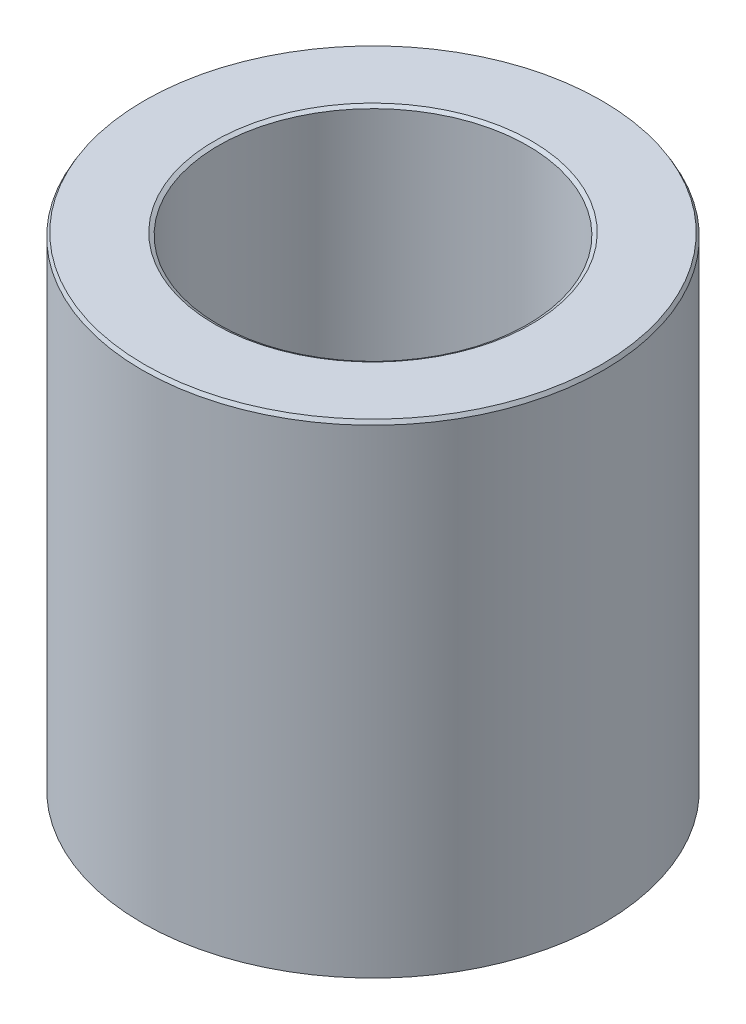
ISO-10303-21;
HEADER;
FILE_DESCRIPTION(('STEP AP214'),'2;1');
FILE_NAME('part.step','',(''),(''),'','','');
FILE_SCHEMA(('AUTOMOTIVE_DESIGN { 1 0 10303 214 1 1 1 1 }'));
ENDSEC;
DATA;
#1=APPLICATION_CONTEXT('core data for automotive mechanical design processes');
#2=APPLICATION_PROTOCOL_DEFINITION('international standard','automotive_design',2000,#1);
#3=PRODUCT_CONTEXT('',#1,'mechanical');
#4=PRODUCT('Part','Part','',(#3));
#5=PRODUCT_RELATED_PRODUCT_CATEGORY('part','',(#4));
#6=PRODUCT_DEFINITION_FORMATION('','',#4);
#7=PRODUCT_DEFINITION_CONTEXT('part definition',#1,'design');
#8=PRODUCT_DEFINITION('design','',#6,#7);
#9=PRODUCT_DEFINITION_SHAPE('','',#8);
#10=(LENGTH_UNIT() NAMED_UNIT(*) SI_UNIT(.MILLI.,.METRE.));
#11=(NAMED_UNIT(*) PLANE_ANGLE_UNIT() SI_UNIT($,.RADIAN.));
#12=(NAMED_UNIT(*) SI_UNIT($,.STERADIAN.) SOLID_ANGLE_UNIT());
#13=UNCERTAINTY_MEASURE_WITH_UNIT(LENGTH_MEASURE(1.E-05),#10,'distance_accuracy_value','');
#14=(GEOMETRIC_REPRESENTATION_CONTEXT(3) GLOBAL_UNCERTAINTY_ASSIGNED_CONTEXT((#13)) GLOBAL_UNIT_ASSIGNED_CONTEXT((#10,
#11,#12)) REPRESENTATION_CONTEXT('',''));
#15=CARTESIAN_POINT('',(0.,0.,0.));
#16=DIRECTION('',(0.,0.,1.));
#17=DIRECTION('',(1.,0.,0.));
#18=AXIS2_PLACEMENT_3D('',#15,#16,#17);
#19=CARTESIAN_POINT('',(0.,57.7614955437771,0.));
#20=DIRECTION('',(0.,-1.,0.));
#21=DIRECTION('',(0.,0.,-1.));
#22=AXIS2_PLACEMENT_3D('',#19,#20,#21);
#23=CYLINDRICAL_SURFACE('',#22,27.5);
#24=CARTESIAN_POINT('',(0.,0.259318501616798,0.));
#25=DIRECTION('',(0.,1.,0.));
#26=DIRECTION('',(0.,0.,1.));
#27=AXIS2_PLACEMENT_3D('',#24,#25,#26);
#28=CIRCLE('',#27,27.5);
#29=CARTESIAN_POINT('',(0.,0.259318501616798,27.5));
#30=VERTEX_POINT('',#29);
#31=EDGE_CURVE('E10',#30,#30,#28,.T.);
#32=ORIENTED_EDGE('',*,*,#31,.T.);
#33=EDGE_LOOP('',(#32));
#34=FACE_BOUND('',#33,.T.);
#35=CARTESIAN_POINT('',(0.,57.3123427236342,0.));
#36=DIRECTION('',(0.,1.,0.));
#37=DIRECTION('',(0.,0.,1.));
#38=AXIS2_PLACEMENT_3D('',#35,#36,#37);
#39=CIRCLE('',#38,27.5);
#40=CARTESIAN_POINT('',(0.,57.3123427236342,27.5));
#41=VERTEX_POINT('',#40);
#42=EDGE_CURVE('E50',#41,#41,#39,.F.);
#43=ORIENTED_EDGE('',*,*,#42,.T.);
#44=EDGE_LOOP('',(#43));
#45=FACE_BOUND('',#44,.T.);
#46=ADVANCED_FACE('F39',(#34,#45),#23,.T.);
#47=CARTESIAN_POINT('',(0.,57.7614955437771,0.));
#48=DIRECTION('',(0.,1.,0.));
#49=DIRECTION('',(0.,0.,1.));
#50=AXIS2_PLACEMENT_3D('',#47,#48,#49);
#51=PLANE('',#50);
#52=CARTESIAN_POINT('',(0.,57.7614955437771,0.));
#53=DIRECTION('',(0.,1.,0.));
#54=DIRECTION('',(0.,0.,1.));
#55=AXIS2_PLACEMENT_3D('',#52,#53,#54);
#56=CIRCLE('',#55,18.8958268331915);
#57=CARTESIAN_POINT('',(0.,57.7614955437771,18.8958268331915));
#58=VERTEX_POINT('',#57);
#59=EDGE_CURVE('E58',#58,#58,#56,.F.);
#60=ORIENTED_EDGE('',*,*,#59,.T.);
#61=EDGE_LOOP('',(#60));
#62=FACE_BOUND('',#61,.T.);
#63=CARTESIAN_POINT('',(0.,57.7614955437771,0.));
#64=DIRECTION('',(0.,1.,0.));
#65=DIRECTION('',(0.,0.,1.));
#66=AXIS2_PLACEMENT_3D('',#63,#64,#65);
#67=CIRCLE('',#66,27.2406814983832);
#68=CARTESIAN_POINT('',(0.,57.7614955437771,27.2406814983832));
#69=VERTEX_POINT('',#68);
#70=EDGE_CURVE('E61',#69,#69,#67,.T.);
#71=ORIENTED_EDGE('',*,*,#70,.T.);
#72=EDGE_LOOP('',(#71));
#73=FACE_BOUND('',#72,.T.);
#74=ADVANCED_FACE('F88',(#62,#73),#51,.T.);
#75=CARTESIAN_POINT('',(0.,0.,0.));
#76=DIRECTION('',(0.,1.,0.));
#77=DIRECTION('',(0.,0.,1.));
#78=AXIS2_PLACEMENT_3D('',#75,#76,#77);
#79=PLANE('',#78);
#80=CARTESIAN_POINT('',(0.,0.,0.));
#81=DIRECTION('',(0.,1.,0.));
#82=DIRECTION('',(0.,0.,1.));
#83=AXIS2_PLACEMENT_3D('',#80,#81,#82);
#84=CIRCLE('',#83,18.7059925146654);
#85=CARTESIAN_POINT('',(0.,0.,18.7059925146654));
#86=VERTEX_POINT('',#85);
#87=EDGE_CURVE('E51',#86,#86,#84,.T.);
#88=ORIENTED_EDGE('',*,*,#87,.T.);
#89=EDGE_LOOP('',(#88));
#90=FACE_BOUND('',#89,.T.);
#91=CARTESIAN_POINT('',(0.,0.,0.));
#92=DIRECTION('',(0.,1.,0.));
#93=DIRECTION('',(0.,0.,1.));
#94=AXIS2_PLACEMENT_3D('',#91,#92,#93);
#95=CIRCLE('',#94,27.0508471798571);
#96=CARTESIAN_POINT('',(0.,0.,27.0508471798571));
#97=VERTEX_POINT('',#96);
#98=EDGE_CURVE('E54',#97,#97,#95,.F.);
#99=ORIENTED_EDGE('',*,*,#98,.T.);
#100=EDGE_LOOP('',(#99));
#101=FACE_BOUND('',#100,.T.);
#102=ADVANCED_FACE('F83',(#90,#101),#79,.F.);
#103=CARTESIAN_POINT('',(0.,57.7614955437771,0.));
#104=DIRECTION('',(0.,-1.,0.));
#105=DIRECTION('',(0.,0.,-1.));
#106=AXIS2_PLACEMENT_3D('',#103,#104,#105);
#107=CYLINDRICAL_SURFACE('',#106,18.4466740130486);
#108=CARTESIAN_POINT('',(0.,57.5021770421603,0.));
#109=DIRECTION('',(0.,1.,0.));
#110=DIRECTION('',(0.,0.,1.));
#111=AXIS2_PLACEMENT_3D('',#108,#109,#110);
#112=CIRCLE('',#111,18.4466740130486);
#113=CARTESIAN_POINT('',(0.,57.5021770421603,18.4466740130486));
#114=VERTEX_POINT('',#113);
#115=EDGE_CURVE('E67',#114,#114,#112,.T.);
#116=ORIENTED_EDGE('',*,*,#115,.T.);
#117=EDGE_LOOP('',(#116));
#118=FACE_BOUND('',#117,.T.);
#119=CARTESIAN_POINT('',(0.,0.449152820142927,0.));
#120=DIRECTION('',(0.,1.,0.));
#121=DIRECTION('',(0.,0.,1.));
#122=AXIS2_PLACEMENT_3D('',#119,#120,#121);
#123=CIRCLE('',#122,18.4466740130486);
#124=CARTESIAN_POINT('',(0.,0.449152820142927,18.4466740130486));
#125=VERTEX_POINT('',#124);
#126=EDGE_CURVE('E69',#125,#125,#123,.F.);
#127=ORIENTED_EDGE('',*,*,#126,.T.);
#128=EDGE_LOOP('',(#127));
#129=FACE_BOUND('',#128,.T.);
#130=ADVANCED_FACE('F71',(#118,#129),#107,.F.);
#131=CARTESIAN_POINT('',(0.,57.5021770421603,0.));
#132=DIRECTION('',(0.,1.,0.));
#133=DIRECTION('',(0.,0.,1.));
#134=AXIS2_PLACEMENT_3D('',#131,#132,#133);
#135=CONICAL_SURFACE('',#134,18.4466740130486,1.0471975511966);
#136=ORIENTED_EDGE('',*,*,#59,.F.);
#137=EDGE_LOOP('',(#136));
#138=FACE_BOUND('',#137,.T.);
#139=ORIENTED_EDGE('',*,*,#115,.F.);
#140=EDGE_LOOP('',(#139));
#141=FACE_BOUND('',#140,.T.);
#142=ADVANCED_FACE('F77',(#138,#141),#135,.F.);
#143=CARTESIAN_POINT('',(0.,0.,0.));
#144=DIRECTION('',(0.,-1.,0.));
#145=DIRECTION('',(0.,0.,-1.));
#146=AXIS2_PLACEMENT_3D('',#143,#144,#145);
#147=CONICAL_SURFACE('',#146,18.7059925146654,0.523598775598292);
#148=ORIENTED_EDGE('',*,*,#126,.F.);
#149=EDGE_LOOP('',(#148));
#150=FACE_BOUND('',#149,.T.);
#151=ORIENTED_EDGE('',*,*,#87,.F.);
#152=EDGE_LOOP('',(#151));
#153=FACE_BOUND('',#152,.T.);
#154=ADVANCED_FACE('F73',(#150,#153),#147,.F.);
#155=CARTESIAN_POINT('',(0.,0.259318501616798,0.));
#156=DIRECTION('',(0.,1.,0.));
#157=DIRECTION('',(0.,0.,1.));
#158=AXIS2_PLACEMENT_3D('',#155,#156,#157);
#159=CONICAL_SURFACE('',#158,27.5,1.04719755119659);
#160=ORIENTED_EDGE('',*,*,#98,.F.);
#161=EDGE_LOOP('',(#160));
#162=FACE_BOUND('',#161,.T.);
#163=ORIENTED_EDGE('',*,*,#31,.F.);
#164=EDGE_LOOP('',(#163));
#165=FACE_BOUND('',#164,.T.);
#166=ADVANCED_FACE('F76',(#162,#165),#159,.T.);
#167=CARTESIAN_POINT('',(0.,57.7614955437771,0.));
#168=DIRECTION('',(0.,-1.,0.));
#169=DIRECTION('',(0.,0.,-1.));
#170=AXIS2_PLACEMENT_3D('',#167,#168,#169);
#171=CONICAL_SURFACE('',#170,27.2406814983832,0.523598775598301);
#172=ORIENTED_EDGE('',*,*,#42,.F.);
#173=EDGE_LOOP('',(#172));
#174=FACE_BOUND('',#173,.T.);
#175=ORIENTED_EDGE('',*,*,#70,.F.);
#176=EDGE_LOOP('',(#175));
#177=FACE_BOUND('',#176,.T.);
#178=ADVANCED_FACE('F45',(#174,#177),#171,.T.);
#179=CLOSED_SHELL('',(#46,#74,#102,#130,#142,#154,#166,#178));
#180=MANIFOLD_SOLID_BREP('B2',#179);
#181=ADVANCED_BREP_SHAPE_REPRESENTATION('',(#18,#180),#14);
#182=SHAPE_DEFINITION_REPRESENTATION(#9,#181);
ENDSEC;
END-ISO-10303-21;
